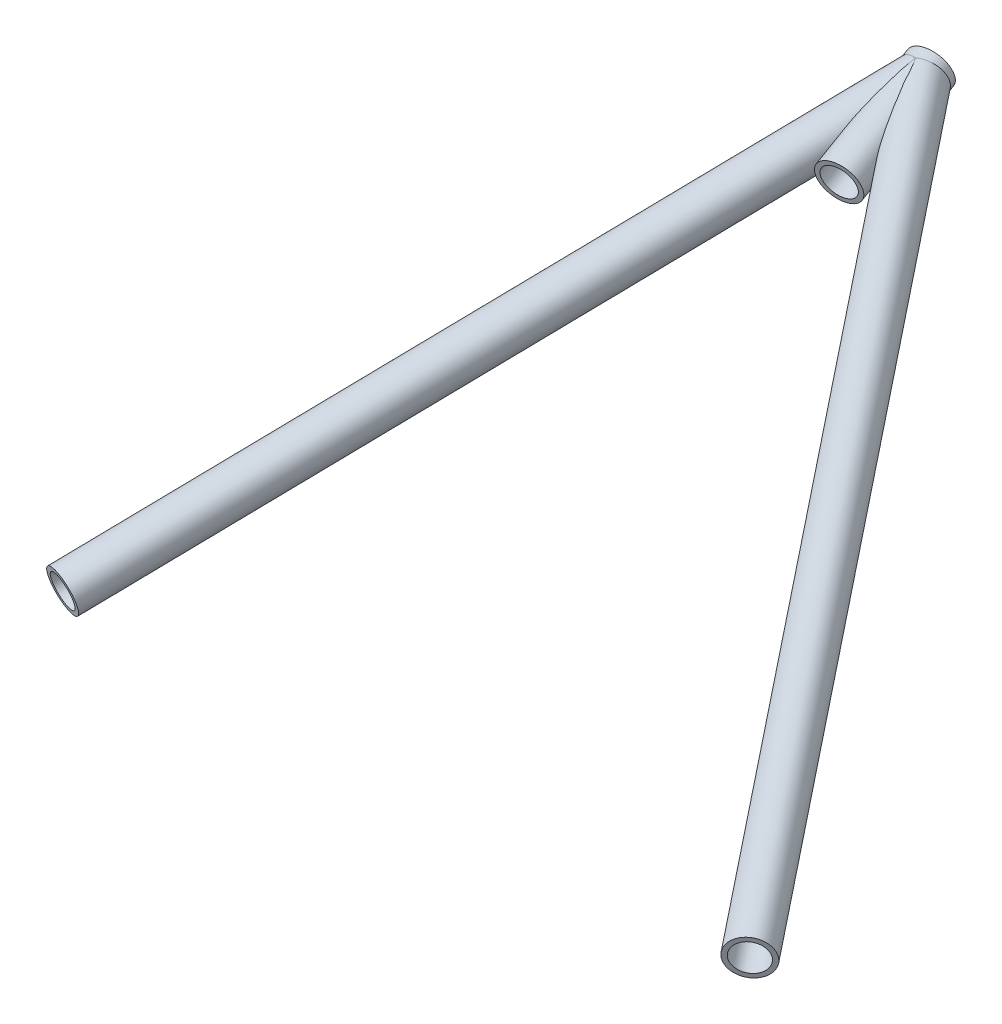
ISO-10303-21;
HEADER;
FILE_DESCRIPTION(('STEP AP214'),'2;1');
FILE_NAME('part.step','',(''),(''),'','','');
FILE_SCHEMA(('AUTOMOTIVE_DESIGN { 1 0 10303 214 1 1 1 1 }'));
ENDSEC;
DATA;
#1=APPLICATION_CONTEXT('core data for automotive mechanical design processes');
#2=APPLICATION_PROTOCOL_DEFINITION('international standard','automotive_design',2000,#1);
#3=PRODUCT_CONTEXT('',#1,'mechanical');
#4=PRODUCT('Part','Part','',(#3));
#5=PRODUCT_RELATED_PRODUCT_CATEGORY('part','',(#4));
#6=PRODUCT_DEFINITION_FORMATION('','',#4);
#7=PRODUCT_DEFINITION_CONTEXT('part definition',#1,'design');
#8=PRODUCT_DEFINITION('design','',#6,#7);
#9=PRODUCT_DEFINITION_SHAPE('','',#8);
#10=(LENGTH_UNIT() NAMED_UNIT(*) SI_UNIT(.MILLI.,.METRE.));
#11=(NAMED_UNIT(*) PLANE_ANGLE_UNIT() SI_UNIT($,.RADIAN.));
#12=(NAMED_UNIT(*) SI_UNIT($,.STERADIAN.) SOLID_ANGLE_UNIT());
#13=UNCERTAINTY_MEASURE_WITH_UNIT(LENGTH_MEASURE(1.E-05),#10,'distance_accuracy_value','');
#14=(GEOMETRIC_REPRESENTATION_CONTEXT(3) GLOBAL_UNCERTAINTY_ASSIGNED_CONTEXT((#13)) GLOBAL_UNIT_ASSIGNED_CONTEXT((#10,
#11,#12)) REPRESENTATION_CONTEXT('',''));
#15=CARTESIAN_POINT('',(0.,0.,0.));
#16=DIRECTION('',(0.,0.,1.));
#17=DIRECTION('',(1.,0.,0.));
#18=AXIS2_PLACEMENT_3D('',#15,#16,#17);
#19=CARTESIAN_POINT('',(1696.18593125395,298.313265774571,-609.984435723737));
#20=DIRECTION('',(0.586936783063146,-0.193365264339262,0.786202955498447));
#21=DIRECTION('',(0.801326519780633,0.,-0.598227221627584));
#22=AXIS2_PLACEMENT_3D('',#19,#20,#21);
#23=CYLINDRICAL_SURFACE('',#22,7.41679999999998);
#24=CARTESIAN_POINT('',(1929.45721259279,221.462462961638,-297.517103442446));
#25=DIRECTION('',(-0.586936783063146,0.193365264339262,-0.786202955498447));
#26=DIRECTION('',(-0.801326519780633,0.,0.598227221627584));
#27=AXIS2_PLACEMENT_3D('',#24,#25,#26);
#28=CIRCLE('',#27,7.41679999999998);
#29=CARTESIAN_POINT('',(1923.51393406088,221.462462961638,-293.080171785078));
#30=VERTEX_POINT('',#29);
#31=EDGE_CURVE('E109',#30,#30,#28,.T.);
#32=ORIENTED_EDGE('',*,*,#31,.F.);
#33=EDGE_LOOP('',(#32));
#34=FACE_BOUND('',#33,.T.);
#35=CARTESIAN_POINT('',(1706.02165747647,297.030905904922,-609.207426175195));
#36=CARTESIAN_POINT('',(1706.00673581778,296.841103519044,-609.227413273846));
#37=CARTESIAN_POINT('',(1705.98733985814,296.650978769853,-609.241045880463));
#38=CARTESIAN_POINT('',(1705.94016060306,296.271275535075,-609.255083840829));
#39=CARTESIAN_POINT('',(1705.9123770868,296.081697064004,-609.255488846298));
#40=CARTESIAN_POINT('',(1705.84919796562,295.704240280113,-609.242515598167));
#41=CARTESIAN_POINT('',(1705.81380072679,295.516362341264,-609.229134383668));
#42=CARTESIAN_POINT('',(1705.73641681489,295.14355209084,-609.188016254505));
#43=CARTESIAN_POINT('',(1705.69443019386,294.958619756022,-609.160279453176));
#44=CARTESIAN_POINT('',(1705.60500902473,294.592385171832,-609.089806818607));
#45=CARTESIAN_POINT('',(1705.55755916885,294.411094880365,-609.047028115088));
#46=CARTESIAN_POINT('',(1705.45885005154,294.053922003974,-608.946028945467));
#47=CARTESIAN_POINT('',(1705.40759079152,293.878039417044,-608.88780848509));
#48=CARTESIAN_POINT('',(1705.30308733114,293.53302727902,-608.755697301747));
#49=CARTESIAN_POINT('',(1705.24984467361,293.363892682493,-608.681818557565));
#50=CARTESIAN_POINT('',(1705.14330876726,293.033396564212,-608.518375530838));
#51=CARTESIAN_POINT('',(1705.09001552187,292.872034548503,-608.428812246744));
#52=CARTESIAN_POINT('',(1704.9879771568,292.565761111547,-608.23915137407));
#53=CARTESIAN_POINT('',(1704.93913696643,292.420431215509,-608.139780057658));
#54=CARTESIAN_POINT('',(1704.84496671516,292.138435012884,-607.927966292064));
#55=CARTESIAN_POINT('',(1704.79963640467,292.001768090361,-607.815524773787));
#56=CARTESIAN_POINT('',(1704.71399469042,291.737586982934,-607.578731415712));
#57=CARTESIAN_POINT('',(1704.67368147738,291.610069505586,-607.454383898296));
#58=CARTESIAN_POINT('',(1704.59921102269,291.364273460401,-607.19516722167));
#59=CARTESIAN_POINT('',(1704.56505451786,291.245995999343,-607.060296805872));
#60=CARTESIAN_POINT('',(1704.49602406218,290.990197697765,-606.746909387567));
#61=CARTESIAN_POINT('',(1704.46308950023,290.855219295926,-606.565886912209));
#62=CARTESIAN_POINT('',(1704.40863425189,290.598581230814,-606.193029772949));
#63=CARTESIAN_POINT('',(1704.38711699707,290.476925580502,-606.001191877536));
#64=CARTESIAN_POINT('',(1704.35524231705,290.245407469113,-605.609097016551));
#65=CARTESIAN_POINT('',(1704.3449108679,290.135572989478,-605.40882157173));
#66=CARTESIAN_POINT('',(1704.33474768124,289.926576611459,-605.002592836891));
#67=CARTESIAN_POINT('',(1704.33491552798,289.827414290628,-604.796639772022));
#68=CARTESIAN_POINT('',(1704.34546053741,289.624377059148,-604.350148388296));
#69=CARTESIAN_POINT('',(1704.35733891784,289.521962016027,-604.108986924925));
#70=CARTESIAN_POINT('',(1704.39194877607,289.327304572146,-603.623312143065));
#71=CARTESIAN_POINT('',(1704.41468461181,289.235066274433,-603.378797516998));
#72=CARTESIAN_POINT('',(1704.46949120538,289.059033999311,-602.887385294032));
#73=CARTESIAN_POINT('',(1704.50157641049,288.975253363104,-602.640484585225));
#74=CARTESIAN_POINT('',(1704.57367149723,288.814977347645,-602.145539495427));
#75=CARTESIAN_POINT('',(1704.61368041333,288.738481082462,-601.897495257369));
#76=CARTESIAN_POINT('',(1704.70070277427,288.591242530618,-601.399212768991));
#77=CARTESIAN_POINT('',(1704.74775842362,288.520539183174,-601.148970493799));
#78=CARTESIAN_POINT('',(1704.8476641574,288.384570506553,-600.648173056871));
#79=CARTESIAN_POINT('',(1704.90051435279,288.319305281554,-600.397617889236));
#80=CARTESIAN_POINT('',(1705.01110306714,288.193603704696,-599.896632614133));
#81=CARTESIAN_POINT('',(1705.06883717548,288.133163089674,-599.646202594999));
#82=CARTESIAN_POINT('',(1705.18852293979,288.016527603164,-599.145367932158));
#83=CARTESIAN_POINT('',(1705.25047460521,287.960332741183,-598.894963288508));
#84=CARTESIAN_POINT('',(1705.38808010555,287.843199643747,-598.354660789383));
#85=CARTESIAN_POINT('',(1705.46435165202,287.782916286716,-598.064778625151));
#86=CARTESIAN_POINT('',(1705.62098996646,287.667023501027,-597.485182064215));
#87=CARTESIAN_POINT('',(1705.70135690703,287.611414269645,-597.195467675104));
#88=CARTESIAN_POINT('',(1705.94765250895,287.451033614131,-596.326516883562));
#89=CARTESIAN_POINT('',(1706.11875695,287.352724913273,-595.74754613239));
#90=CARTESIAN_POINT('',(1706.47110520859,287.171548314561,-594.589550732133));
#91=CARTESIAN_POINT('',(1706.65236090523,287.088699019974,-594.010526846369));
#92=CARTESIAN_POINT('',(1707.02209947316,286.93802506366,-592.852894680539));
#93=CARTESIAN_POINT('',(1707.21058169521,286.870199055929,-592.274286367874));
#94=CARTESIAN_POINT('',(1707.59246434981,286.749890463263,-591.117994085909));
#95=CARTESIAN_POINT('',(1707.78585763146,286.697386820126,-590.540309943514));
#96=CARTESIAN_POINT('',(1708.17618712582,286.608601588453,-589.384831406686));
#97=CARTESIAN_POINT('',(1708.37312360939,286.572321245674,-588.807037007195));
#98=CARTESIAN_POINT('',(1708.76884935907,286.517887406104,-587.651988106915));
#99=CARTESIAN_POINT('',(1708.96763610266,286.499712088531,-587.074733795968));
#100=CARTESIAN_POINT('',(1709.36585764206,286.484402892454,-585.920230744267));
#101=CARTESIAN_POINT('',(1709.56529232166,286.487265428812,-585.342982019326));
#102=CARTESIAN_POINT('',(1709.92434349182,286.515732490038,-584.301544890679));
#103=CARTESIAN_POINT('',(1710.08412654167,286.536784393966,-583.837302363674));
#104=CARTESIAN_POINT('',(1710.32253589936,286.583910962291,-583.141336189893));
#105=CARTESIAN_POINT('',(1710.401829734,286.602222856646,-582.90931082402));
#106=CARTESIAN_POINT('',(1710.55977926024,286.64474160028,-582.445580578367));
#107=CARTESIAN_POINT('',(1710.6384349676,286.668948303468,-582.213875690787));
#108=CARTESIAN_POINT('',(1710.79460151518,286.724031429803,-581.751758482221));
#109=CARTESIAN_POINT('',(1710.87211535122,286.754884755291,-581.521344450945));
#110=CARTESIAN_POINT('',(1711.02595160608,286.824433960921,-581.061307595501));
#111=CARTESIAN_POINT('',(1711.10227412188,286.86312919911,-580.831684708133));
#112=CARTESIAN_POINT('',(1711.25320225255,286.949809507487,-580.373947594193));
#113=CARTESIAN_POINT('',(1711.32780993863,286.997782631775,-580.145831813581));
#114=CARTESIAN_POINT('',(1711.47476981037,287.105072688683,-579.691583083834));
#115=CARTESIAN_POINT('',(1711.54712283632,287.164385334939,-579.465449419127));
#116=CARTESIAN_POINT('',(1711.66234858359,287.272609602529,-579.099760179352));
#117=CARTESIAN_POINT('',(1711.70619201726,287.317205412571,-578.959235356503));
#118=CARTESIAN_POINT('',(1711.79226987723,287.413056832389,-578.67990618022));
#119=CARTESIAN_POINT('',(1711.83450387985,287.464314180375,-578.541102286222));
#120=CARTESIAN_POINT('',(1711.91678843494,287.574642384202,-578.266247417052));
#121=CARTESIAN_POINT('',(1711.95684273,287.633699209502,-578.130191992748));
#122=CARTESIAN_POINT('',(1712.0341229033,287.76129777923,-577.86182145355));
#123=CARTESIAN_POINT('',(1712.07135048488,287.829833740236,-577.729504116803));
#124=CARTESIAN_POINT('',(1712.14415679505,287.983104737118,-577.462361580691));
#125=CARTESIAN_POINT('',(1712.17949155459,288.068578983069,-577.327886500858));
#126=CARTESIAN_POINT('',(1712.24394632056,288.255738715878,-577.068864806687));
#127=CARTESIAN_POINT('',(1712.27307051578,288.357413194898,-576.944311536202));
#128=CARTESIAN_POINT('',(1712.31676178159,288.555357291404,-576.737394655839));
#129=CARTESIAN_POINT('',(1712.33312563671,288.647804562354,-576.651807160795));
#130=CARTESIAN_POINT('',(1712.35855524456,288.845109744886,-576.495046582663));
#131=CARTESIAN_POINT('',(1712.36763565059,288.949942248802,-576.423844774669));
#132=CARTESIAN_POINT('',(1712.37606554908,289.152573284875,-576.31106599501));
#133=CARTESIAN_POINT('',(1712.37677858194,289.24865718231,-576.266534741664));
#134=CARTESIAN_POINT('',(1712.37142939253,289.446525748462,-576.193388794709));
#135=CARTESIAN_POINT('',(1712.365370577,289.548307526266,-576.164766108757));
#136=CARTESIAN_POINT('',(1712.34670248247,289.754335666234,-576.1242603837));
#137=CARTESIAN_POINT('',(1712.33410436199,289.858577542222,-576.11234895669));
#138=CARTESIAN_POINT('',(1712.30323170095,290.066821202277,-576.104097505337));
#139=CARTESIAN_POINT('',(1712.2849515195,290.17082264383,-576.107773000996));
#140=CARTESIAN_POINT('',(1712.23374349447,290.427091717086,-576.13364890604));
#141=CARTESIAN_POINT('',(1712.19803322785,290.577943414102,-576.164070528728));
#142=CARTESIAN_POINT('',(1712.11990691476,290.871661501556,-576.2468419912));
#143=CARTESIAN_POINT('',(1712.07747193579,291.014503757398,-576.299254451012));
#144=CARTESIAN_POINT('',(1711.99101913826,291.283312743292,-576.416036696457));
#145=CARTESIAN_POINT('',(1711.94725734547,291.40977722868,-576.479477794236));
#146=CARTESIAN_POINT('',(1711.85710419034,291.656081683409,-576.616653503584));
#147=CARTESIAN_POINT('',(1711.81071033497,291.775915152449,-576.690397974325));
#148=CARTESIAN_POINT('',(1711.71600798229,292.00991252984,-576.845839760501));
#149=CARTESIAN_POINT('',(1711.6676951672,292.124062178366,-576.927555692528));
#150=CARTESIAN_POINT('',(1711.56980114917,292.347085047603,-577.097028804988));
#151=CARTESIAN_POINT('',(1711.52022050266,292.45596052433,-577.184783362827));
#152=CARTESIAN_POINT('',(1711.38715304752,292.739401042865,-577.424522917533));
#153=CARTESIAN_POINT('',(1711.30284509883,292.909995013015,-577.580740213895));
#154=CARTESIAN_POINT('',(1711.13265204176,293.241122300947,-577.902754895929));
#155=CARTESIAN_POINT('',(1711.04676604302,293.401649698626,-578.068557810729));
#156=CARTESIAN_POINT('',(1710.87387441638,293.714609589258,-578.407710368127));
#157=CARTESIAN_POINT('',(1710.78686695639,293.867025959006,-578.581073880676));
#158=CARTESIAN_POINT('',(1710.61227074065,294.164767523639,-578.933511090491));
#159=CARTESIAN_POINT('',(1710.52468191809,294.31009188673,-579.112585453506));
#160=CARTESIAN_POINT('',(1710.34873284269,294.595385174957,-579.476300230731));
#161=CARTESIAN_POINT('',(1710.2603709514,294.735322101025,-579.660964865286));
#162=CARTESIAN_POINT('',(1710.0835185762,295.009834312928,-580.034179027311));
#163=CARTESIAN_POINT('',(1709.995028087,295.144409371163,-580.222728719179));
#164=CARTESIAN_POINT('',(1709.81817770761,295.408656306455,-580.602883213475));
#165=CARTESIAN_POINT('',(1709.72981779317,295.538334138427,-580.794483874426));
#166=CARTESIAN_POINT('',(1709.5532326434,295.793468518336,-581.180529418666));
#167=CARTESIAN_POINT('',(1709.46500740763,295.918925080448,-581.374974292404));
#168=CARTESIAN_POINT('',(1709.26753189215,296.195839263943,-581.813575179307));
#169=CARTESIAN_POINT('',(1709.15834361105,296.346268764314,-582.058408147956));
#170=CARTESIAN_POINT('',(1708.94047925172,296.641904198261,-582.551437404445));
#171=CARTESIAN_POINT('',(1708.83180319474,296.787109916689,-582.799633830235));
#172=CARTESIAN_POINT('',(1708.50672987952,297.215720168797,-583.548754145803));
#173=CARTESIAN_POINT('',(1708.29131526716,297.492079215525,-584.05414730699));
#174=CARTESIAN_POINT('',(1707.86394908448,298.029358806916,-585.075455900364));
#175=CARTESIAN_POINT('',(1707.65200262478,298.290257834289,-585.591384713585));
#176=CARTESIAN_POINT('',(1707.23308990091,298.798174372415,-586.631950672212));
#177=CARTESIAN_POINT('',(1707.02612319946,299.045193104549,-587.156587046127));
#178=CARTESIAN_POINT('',(1706.61935295359,299.525794468289,-588.212153464212));
#179=CARTESIAN_POINT('',(1706.41952630141,299.759422274003,-588.743054047122));
#180=CARTESIAN_POINT('',(1706.0281330771,300.214901758383,-589.812954910295));
#181=CARTESIAN_POINT('',(1705.83656722131,300.436752416183,-590.351955887538));
#182=CARTESIAN_POINT('',(1705.46447674254,300.86852222511,-591.43777069037));
#183=CARTESIAN_POINT('',(1705.28394023396,301.07845420233,-591.98457529332));
#184=CARTESIAN_POINT('',(1705.02404590805,301.38402632937,-592.811594497165));
#185=CARTESIAN_POINT('',(1704.93923824896,301.48432291872,-593.088383963408));
#186=CARTESIAN_POINT('',(1704.77388372001,301.681605867048,-593.644400902294));
#187=CARTESIAN_POINT('',(1704.69333675348,301.778592301101,-593.923628319463));
#188=CARTESIAN_POINT('',(1704.51192637859,301.999837866402,-594.575656713254));
#189=CARTESIAN_POINT('',(1704.41294215486,302.122745169429,-594.949446314826));
#190=CARTESIAN_POINT('',(1704.22590400146,302.361235219671,-595.70216356258));
#191=CARTESIAN_POINT('',(1704.13785201856,302.476816660527,-596.081092110605));
#192=CARTESIAN_POINT('',(1703.97560387456,302.698979875966,-596.844663910848));
#193=CARTESIAN_POINT('',(1703.90140957647,302.805560439425,-597.229307923957));
#194=CARTESIAN_POINT('',(1703.80350158889,302.956577499446,-597.810778757054));
#195=CARTESIAN_POINT('',(1703.77309814692,303.0054371836,-598.005336760058));
#196=CARTESIAN_POINT('',(1703.71736693563,303.099709635623,-598.396002873596));
#197=CARTESIAN_POINT('',(1703.69203886101,303.145122610715,-598.592110890157));
#198=CARTESIAN_POINT('',(1703.63920424214,303.247239092256,-599.055441149856));
#199=CARTESIAN_POINT('',(1703.61408758233,303.302265615709,-599.323317975052));
#200=CARTESIAN_POINT('',(1703.57632486432,303.402974452684,-599.861780445373));
#201=CARTESIAN_POINT('',(1703.56368020701,303.448655716066,-600.132366391346));
#202=CARTESIAN_POINT('',(1703.55302492076,303.527957835842,-600.675088985327));
#203=CARTESIAN_POINT('',(1703.55498424677,303.561603304246,-600.947221299288));
#204=CARTESIAN_POINT('',(1703.57560953296,303.613579630977,-601.492329313605));
#205=CARTESIAN_POINT('',(1703.59426754657,303.631917765739,-601.765304551261));
#206=CARTESIAN_POINT('',(1703.64166067538,303.646649213793,-602.229214343993));
#207=CARTESIAN_POINT('',(1703.66576557641,303.647938111784,-602.420468216501));
#208=CARTESIAN_POINT('',(1703.7232837008,303.639386832468,-602.801301179637));
#209=CARTESIAN_POINT('',(1703.75669390253,303.629550264671,-602.990880793351));
#210=CARTESIAN_POINT('',(1703.83263666698,303.597264495231,-603.36696882085));
#211=CARTESIAN_POINT('',(1703.87516104348,303.574826582806,-603.553479829994));
#212=CARTESIAN_POINT('',(1703.96867035452,303.516035149325,-603.922161590667));
#213=CARTESIAN_POINT('',(1704.01965520963,303.479681758911,-604.104332382926));
#214=CARTESIAN_POINT('',(1704.12921348921,303.391810975629,-604.464020979565));
#215=CARTESIAN_POINT('',(1704.18783416722,303.340196378838,-604.641500759702));
#216=CARTESIAN_POINT('',(1704.31066257574,303.221380345888,-604.989171276509));
#217=CARTESIAN_POINT('',(1704.37487047642,303.154178434865,-605.159361790927));
#218=CARTESIAN_POINT('',(1704.50685022478,303.004123904674,-605.491409264894));
#219=CARTESIAN_POINT('',(1704.57462459378,302.921260103077,-605.653260164318));
#220=CARTESIAN_POINT('',(1704.71149643146,302.740345560522,-605.967632819523));
#221=CARTESIAN_POINT('',(1704.7805938602,302.642295277433,-606.120154856373));
#222=CARTESIAN_POINT('',(1704.91207926615,302.440813402789,-606.402634675259));
#223=CARTESIAN_POINT('',(1704.97453495645,302.338562260688,-606.533406155521));
#224=CARTESIAN_POINT('',(1705.09725023908,302.122786528703,-606.786375396151));
#225=CARTESIAN_POINT('',(1705.15750999158,302.009262763299,-606.908573782442));
#226=CARTESIAN_POINT('',(1705.27449711503,301.771795643232,-607.144226055896));
#227=CARTESIAN_POINT('',(1705.33122431584,301.647851787407,-607.257679521963));
#228=CARTESIAN_POINT('',(1705.43998907526,301.390465951181,-607.475716984243));
#229=CARTESIAN_POINT('',(1705.49202637474,301.257023446708,-607.580300490372));
#230=CARTESIAN_POINT('',(1705.59352103876,300.972956739631,-607.786768650459));
#231=CARTESIAN_POINT('',(1705.64261233877,300.821779859197,-607.888073409145));
#232=CARTESIAN_POINT('',(1705.73344819626,300.510927862242,-608.08042097972));
#233=CARTESIAN_POINT('',(1705.77519243856,300.351252381524,-608.171463351307));
#234=CARTESIAN_POINT('',(1705.85059754308,300.024558911171,-608.343132168399));
#235=CARTESIAN_POINT('',(1705.88425818011,299.857540717134,-608.423758323696));
#236=CARTESIAN_POINT('',(1705.94295375268,299.517322246039,-608.57439571225));
#237=CARTESIAN_POINT('',(1705.96798890052,299.344122121244,-608.644407206726));
#238=CARTESIAN_POINT('',(1706.00856653463,298.997084885626,-608.771957469955));
#239=CARTESIAN_POINT('',(1706.02433090875,298.823372195914,-608.829764537273));
#240=CARTESIAN_POINT('',(1706.04716569101,298.472146667269,-608.934808525344));
#241=CARTESIAN_POINT('',(1706.05423280684,298.294632415119,-608.98204143775));
#242=CARTESIAN_POINT('',(1706.05965577032,297.936913822987,-609.065589878692));
#243=CARTESIAN_POINT('',(1706.05801127669,297.756709377892,-609.101904979462));
#244=CARTESIAN_POINT('',(1706.04616714856,297.394737048595,-609.163234889436));
#245=CARTESIAN_POINT('',(1706.03597075834,297.212969783147,-609.188253978397));
#246=CARTESIAN_POINT('',(1706.02165747647,297.030905904922,-609.207426175195));
#247=B_SPLINE_CURVE_WITH_KNOTS('',3,(#35,#36,#37,#38,#39,#40,#41,#42,#43,#44,#45,#46,#47,#48,
#49,#50,#51,#52,#53,#54,#55,#56,#57,#58,#59,#60,#61,#62,#63,#64,#65,#66,#67,#68,#69,#70,#71,#72,
#73,#74,#75,#76,#77,#78,#79,#80,#81,#82,#83,#84,#85,#86,#87,#88,#89,#90,#91,#92,#93,#94,#95,#96,
#97,#98,#99,#100,#101,#102,#103,#104,#105,#106,#107,#108,#109,#110,#111,#112,#113,#114,#115,
#116,#117,#118,#119,#120,#121,#122,#123,#124,#125,#126,#127,#128,#129,#130,#131,#132,#133,#134,
#135,#136,#137,#138,#139,#140,#141,#142,#143,#144,#145,#146,#147,#148,#149,#150,#151,#152,#153,
#154,#155,#156,#157,#158,#159,#160,#161,#162,#163,#164,#165,#166,#167,#168,#169,#170,#171,#172,
#173,#174,#175,#176,#177,#178,#179,#180,#181,#182,#183,#184,#185,#186,#187,#188,#189,#190,#191,
#192,#193,#194,#195,#196,#197,#198,#199,#200,#201,#202,#203,#204,#205,#206,#207,#208,#209,#210,
#211,#212,#213,#214,#215,#216,#217,#218,#219,#220,#221,#222,#223,#224,#225,#226,#227,#228,#229,
#230,#231,#232,#233,#234,#235,#236,#237,#238,#239,#240,#241,#242,#243,#244,#245,#246),
.UNSPECIFIED.,.T.,.F.,(4,2,2,2,2,2,2,2,2,2,2,2,2,2,2,2,2,2,2,2,2,2,2,2,2,2,2,2,2,2,2,2,2,2,2,2,
2,2,2,2,2,2,2,2,2,2,2,2,2,2,2,2,2,2,2,2,2,2,2,2,2,2,2,2,2,2,2,2,2,2,2,2,2,2,2,2,2,2,2,2,2,2,2,2,
2,2,2,2,2,2,2,2,2,2,2,2,2,2,2,2,2,2,2,2,2,4),(0.,0.574151275382462,1.14831766800678,
1.72260740137623,2.296892600893,2.87282799279553,3.44876317115333,4.02425933197849,
4.59971887104737,5.14712857839256,5.69449932114901,6.24167209321343,6.78891030602429,
7.47242075871127,8.15613652935075,8.84143666399751,9.52670966171098,10.3129926627842,
11.0995915267926,11.8874124032728,12.6751373416048,13.4677842361595,14.2604463120172,
15.0524000320317,15.8443555253407,16.7615301813815,17.6787435284927,19.5134019947082,
21.3502541791536,23.1869417250939,25.0210930128394,26.8553851173875,28.6874637870278,
30.5192302527021,31.9931047554359,32.7306971522825,33.4682712713172,34.2033224460803,
34.9383134725017,35.6723643744238,36.4061383500634,36.8674478385666,37.3288779401915,
37.7894889992185,38.2498202593181,38.7385918041611,39.2270326407056,39.6069008107843,
39.9860028075153,40.3022625540152,40.6183632700834,40.9339263637531,41.2498037394128,
41.7210220392224,42.1935913627706,42.6372242234307,43.0812845358824,43.5264079361407,
43.9713392233644,44.70935405677,45.4477989196802,46.1876606828538,46.927609013856,
47.6714288978679,48.4152803217858,49.1581960318027,49.9011092472057,50.8232310969298,
51.745390881927,53.5899441500655,55.4370071241908,57.2839073127778,59.1241577876502,
60.9645675194093,62.8029576451338,63.7220281708869,64.6410778379327,65.8580786438684,
67.0752958603398,68.2926766009728,68.9012654897403,69.5098177602161,70.3332966156811,
71.1568679558482,71.9787454149558,72.8002319667779,73.3780667227969,73.9557140616899,
74.5328447249371,75.1099699700809,75.6908533584024,76.2717544454759,76.8530718675366,
77.4343717664691,77.9658767475643,78.4973428829746,79.0288345942676,79.5603556525165,
80.12518725201,80.6900430761221,81.2549146343663,81.8197722892924,82.3704935408063,
82.9214232021492,83.4723744464766,84.0231167746117),.UNSPECIFIED.);
#248=CARTESIAN_POINT('',(1706.02165747647,297.030905904922,-609.207426175195));
#249=VERTEX_POINT('',#248);
#250=EDGE_CURVE('E83',#249,#249,#247,.T.);
#251=ORIENTED_EDGE('',*,*,#250,.T.);
#252=EDGE_LOOP('',(#251));
#253=FACE_BOUND('',#252,.T.);
#254=ADVANCED_FACE('F65',(#34,#253),#23,.F.);
#255=CARTESIAN_POINT('',(1695.27005223557,299.62724687487,-614.720955468418));
#256=DIRECTION('',(0.18317580367567,-0.262796220059855,0.94730394893615));
#257=DIRECTION('',(0.,-0.963608030897897,-0.267319215151245));
#258=AXIS2_PLACEMENT_3D('',#255,#256,#257);
#259=CYLINDRICAL_SURFACE('',#258,9.52499999999994);
#260=ORIENTED_EDGE('',*,*,#250,.F.);
#261=EDGE_LOOP('',(#260));
#262=FACE_BOUND('',#261,.T.);
#263=CARTESIAN_POINT('',(1696.18593125395,298.313265774571,-609.984435723738));
#264=DIRECTION('',(0.394737380314413,-0.233815149177805,0.88854537115303));
#265=DIRECTION('',(0.917171793543887,0.157717356150483,-0.365952369436776));
#266=AXIS2_PLACEMENT_3D('',#263,#264,#265);
#267=ELLIPSE('',#266,9.76447759000189,9.52499999999998);
#268=CARTESIAN_POINT('',(1695.66611562887,307.451587268054,-607.348814924447));
#269=VERTEX_POINT('',#268);
#270=CARTESIAN_POINT('',(1696.70574687903,289.174944281087,-612.620056523029));
#271=VERTEX_POINT('',#270);
#272=EDGE_CURVE('E74',#269,#271,#267,.F.);
#273=ORIENTED_EDGE('',*,*,#272,.T.);
#274=CARTESIAN_POINT('',(1696.18593125395,298.313265774571,-609.984435723738));
#275=DIRECTION('',(0.917171793543887,0.157717356150483,-0.365952369436776));
#276=DIRECTION('',(0.394737380314413,-0.233815149177805,0.88854537115303));
#277=AXIS2_PLACEMENT_3D('',#274,#275,#276);
#278=ELLIPSE('',#277,43.2734304674934,9.52499999999998);
#279=EDGE_CURVE('E13',#271,#269,#278,.F.);
#280=ORIENTED_EDGE('',*,*,#279,.T.);
#281=EDGE_LOOP('',(#273,#280));
#282=FACE_BOUND('',#281,.T.);
#283=ADVANCED_FACE('F81',(#262,#282),#259,.F.);
#284=CARTESIAN_POINT('',(1696.18593125395,298.313265774571,-609.984435723737));
#285=DIRECTION('',(0.586936783063146,-0.193365264339262,0.786202955498447));
#286=DIRECTION('',(0.801326519780633,0.,-0.598227221627584));
#287=AXIS2_PLACEMENT_3D('',#284,#285,#286);
#288=CYLINDRICAL_SURFACE('',#287,9.52500000000001);
#289=CARTESIAN_POINT('',(1929.45721259279,221.462462961638,-297.517103442446));
#290=DIRECTION('',(-0.586936783063146,0.193365264339262,-0.786202955498447));
#291=DIRECTION('',(-0.801326519780633,0.,0.598227221627584));
#292=AXIS2_PLACEMENT_3D('',#289,#290,#291);
#293=CIRCLE('',#292,9.52500000000001);
#294=CARTESIAN_POINT('',(1921.82457749188,221.462462961638,-291.818989156443));
#295=VERTEX_POINT('',#294);
#296=EDGE_CURVE('E69',#295,#295,#293,.T.);
#297=ORIENTED_EDGE('',*,*,#296,.T.);
#298=EDGE_LOOP('',(#297));
#299=FACE_BOUND('',#298,.T.);
#300=ORIENTED_EDGE('',*,*,#272,.F.);
#301=ORIENTED_EDGE('',*,*,#279,.F.);
#302=EDGE_LOOP('',(#300,#301));
#303=FACE_BOUND('',#302,.T.);
#304=ADVANCED_FACE('F67',(#299,#303),#288,.T.);
#305=CARTESIAN_POINT('',(1929.45721259279,221.462462961638,-297.517103442446));
#306=DIRECTION('',(-0.586936783063146,0.193365264339262,-0.786202955498447));
#307=DIRECTION('',(-0.801326519780633,0.,0.598227221627584));
#308=AXIS2_PLACEMENT_3D('',#305,#306,#307);
#309=PLANE('',#308);
#310=ORIENTED_EDGE('',*,*,#31,.T.);
#311=EDGE_LOOP('',(#310));
#312=FACE_BOUND('',#311,.T.);
#313=ORIENTED_EDGE('',*,*,#296,.F.);
#314=EDGE_LOOP('',(#313));
#315=FACE_BOUND('',#314,.T.);
#316=ADVANCED_FACE('F86',(#312,#315),#309,.F.);
#317=CLOSED_SHELL('',(#254,#283,#304,#316));
#318=MANIFOLD_SOLID_BREP('B2',#317);
#319=CARTESIAN_POINT('',(1600.,194.785610189008,-270.));
#320=DIRECTION('',(0.261244511464905,0.281184903592084,-0.923410177126814));
#321=DIRECTION('',(0.,0.956631443980582,0.291301013365261));
#322=AXIS2_PLACEMENT_3D('',#319,#320,#321);
#323=CYLINDRICAL_SURFACE('',#322,7.41679999999998);
#324=CARTESIAN_POINT('',(1609.14355790127,204.627081814731,-302.319356199439));
#325=DIRECTION('',(0.261244511464905,0.281184903592084,-0.923410177126814));
#326=DIRECTION('',(0.,0.956631443980581,0.291301013365261));
#327=AXIS2_PLACEMENT_3D('',#324,#325,#326);
#328=CIRCLE('',#327,7.41679999999998);
#329=CARTESIAN_POINT('',(1609.14355790127,211.722225908446,-300.158834843511));
#330=VERTEX_POINT('',#329);
#331=EDGE_CURVE('E184',#330,#330,#328,.T.);
#332=ORIENTED_EDGE('',*,*,#331,.F.);
#333=EDGE_LOOP('',(#332));
#334=FACE_BOUND('',#333,.T.);
#335=CARTESIAN_POINT('',(1692.35451797443,301.284550700558,-594.281176205588));
#336=CARTESIAN_POINT('',(1692.40321256167,301.19489699609,-593.986749530908));
#337=CARTESIAN_POINT('',(1692.44833392335,301.101948032664,-593.692735606924));
#338=CARTESIAN_POINT('',(1692.53255673058,300.910417652576,-593.105669620011));
#339=CARTESIAN_POINT('',(1692.57165764861,300.811835743391,-592.812617643568));
#340=CARTESIAN_POINT('',(1692.64477115754,300.609698549196,-592.22748831856));
#341=CARTESIAN_POINT('',(1692.67878200232,300.506141573557,-591.935411337899));
#342=CARTESIAN_POINT('',(1692.74245671099,300.294575305461,-591.352393895294));
#343=CARTESIAN_POINT('',(1692.77212040604,300.186565840279,-591.061453477921));
#344=CARTESIAN_POINT('',(1692.85565928255,299.856040353689,-590.189426959023));
#345=CARTESIAN_POINT('',(1692.90396271021,299.627373076613,-589.610129258401));
#346=CARTESIAN_POINT('',(1692.98960354427,299.155359138829,-588.456898481575));
#347=CARTESIAN_POINT('',(1693.02694290721,298.912015106544,-587.882964465941));
#348=CARTESIAN_POINT('',(1693.09368746726,298.408752980053,-586.735632212745));
#349=CARTESIAN_POINT('',(1693.12301659658,298.148703123124,-586.162287370279));
#350=CARTESIAN_POINT('',(1693.17534822545,297.613681295601,-585.022246750042));
#351=CARTESIAN_POINT('',(1693.19835018428,297.338708052062,-584.455551544506));
#352=CARTESIAN_POINT('',(1693.23955544476,296.773219693495,-583.331082260448));
#353=CARTESIAN_POINT('',(1693.25776744769,296.482733929654,-582.773293758744));
#354=CARTESIAN_POINT('',(1693.29069950934,295.883773828645,-581.667390754462));
#355=CARTESIAN_POINT('',(1693.30542006517,295.575302060125,-581.119274884992));
#356=CARTESIAN_POINT('',(1693.3256781672,295.097021289804,-580.307149116838));
#357=CARTESIAN_POINT('',(1693.33212023512,294.935208505741,-580.038441270598));
#358=CARTESIAN_POINT('',(1693.34453395958,294.605688475307,-579.504654778778));
#359=CARTESIAN_POINT('',(1693.35050563145,294.437981421193,-579.239576015215));
#360=CARTESIAN_POINT('',(1693.36212452755,294.095544985388,-578.713089268));
#361=CARTESIAN_POINT('',(1693.36777095678,293.920800035183,-578.45169136843));
#362=CARTESIAN_POINT('',(1693.37886544024,293.563725131696,-577.934144729642));
#363=CARTESIAN_POINT('',(1693.38431351374,293.381395919245,-577.677995481366));
#364=CARTESIAN_POINT('',(1693.39512999131,293.009325898411,-577.17414862671));
#365=CARTESIAN_POINT('',(1693.40049868579,292.819653054926,-576.926401092177));
#366=CARTESIAN_POINT('',(1693.41138578613,292.429988104305,-576.439202455458));
#367=CARTESIAN_POINT('',(1693.41690416353,292.22999795278,-576.199749795285));
#368=CARTESIAN_POINT('',(1693.42831297223,291.818084776206,-575.73264719619));
#369=CARTESIAN_POINT('',(1693.43420205473,291.606205284953,-575.504959399402));
#370=CARTESIAN_POINT('',(1693.44357642706,291.276706065847,-575.175303674284));
#371=CARTESIAN_POINT('',(1693.44678992795,291.164974072197,-575.067439158021));
#372=CARTESIAN_POINT('',(1693.45345578117,290.937053185211,-574.856548811978));
#373=CARTESIAN_POINT('',(1693.45690808842,290.820865134657,-574.753522075338));
#374=CARTESIAN_POINT('',(1693.46416850838,290.58185817668,-574.55219176005));
#375=CARTESIAN_POINT('',(1693.46798065028,290.458972878213,-574.453966637352));
#376=CARTESIAN_POINT('',(1693.47601856145,290.207108078141,-574.265380550495));
#377=CARTESIAN_POINT('',(1693.48024466084,290.078123755754,-574.175025973264));
#378=CARTESIAN_POINT('',(1693.48919503974,289.814266466425,-574.005447157257));
#379=CARTESIAN_POINT('',(1693.49391556695,289.679441841019,-573.926148409514));
#380=CARTESIAN_POINT('',(1693.50401909068,289.402516013704,-573.781747967443));
#381=CARTESIAN_POINT('',(1693.50940093023,289.260427766872,-573.716622015935));
#382=CARTESIAN_POINT('',(1693.5198223221,288.998281083395,-573.617144449172));
#383=CARTESIAN_POINT('',(1693.52471022339,288.879593435595,-573.579230944988));
#384=CARTESIAN_POINT('',(1693.53509416451,288.638036944649,-573.519566295602));
#385=CARTESIAN_POINT('',(1693.54059039493,288.515166799481,-573.497820232384));
#386=CARTESIAN_POINT('',(1693.55228427072,288.265802772052,-573.474637949174));
#387=CARTESIAN_POINT('',(1693.55848975368,288.139282863191,-573.473456367367));
#388=CARTESIAN_POINT('',(1693.5714344696,287.888500239805,-573.495655116016));
#389=CARTESIAN_POINT('',(1693.57817262495,287.764233563228,-573.51898697485));
#390=CARTESIAN_POINT('',(1693.59117149443,287.536579444934,-573.586511623852));
#391=CARTESIAN_POINT('',(1693.59740188151,287.432407495432,-573.628093664458));
#392=CARTESIAN_POINT('',(1693.60988857766,287.232772113681,-573.728591283975));
#393=CARTESIAN_POINT('',(1693.61614490788,287.137318519956,-573.787526136193));
#394=CARTESIAN_POINT('',(1693.63044960658,286.928222146603,-573.939776842204));
#395=CARTESIAN_POINT('',(1693.63844560271,286.818244568201,-574.038079741028));
#396=CARTESIAN_POINT('',(1693.65399954518,286.615042392466,-574.250678782107));
#397=CARTESIAN_POINT('',(1693.66155641545,286.521857862588,-574.365012047077));
#398=CARTESIAN_POINT('',(1693.67537600759,286.359400448225,-574.590896724713));
#399=CARTESIAN_POINT('',(1693.68168997114,286.288627941542,-574.701390629913));
#400=CARTESIAN_POINT('',(1693.69394206882,286.156756791295,-574.928085334802));
#401=CARTESIAN_POINT('',(1693.69987987327,286.09566656528,-575.044290986426));
#402=CARTESIAN_POINT('',(1693.71141104023,285.981540616268,-575.28087500405));
#403=CARTESIAN_POINT('',(1693.71700361954,285.92852283449,-575.401261954864));
#404=CARTESIAN_POINT('',(1693.72785534109,285.829436725207,-575.644794110324));
#405=CARTESIAN_POINT('',(1693.73311460525,285.783365848355,-575.767938283989));
#406=CARTESIAN_POINT('',(1693.74617413707,285.673057838698,-576.085461377677));
#407=CARTESIAN_POINT('',(1693.75375733294,285.61300283284,-576.281298197425));
#408=CARTESIAN_POINT('',(1693.76826521507,285.504163442238,-576.676141269604));
#409=CARTESIAN_POINT('',(1693.77518953886,285.455385240413,-576.875149197098));
#410=CARTESIAN_POINT('',(1693.78844696752,285.366959840808,-577.275566841505));
#411=CARTESIAN_POINT('',(1693.79477895271,285.327329736044,-577.476980326651));
#412=CARTESIAN_POINT('',(1693.80688066342,285.255759496191,-577.881190386604));
#413=CARTESIAN_POINT('',(1693.8126503225,285.223820269084,-578.083987121813));
#414=CARTESIAN_POINT('',(1693.82369444851,285.16627341328,-578.491890488786));
#415=CARTESIAN_POINT('',(1693.82896527221,285.140710424113,-578.697003443334));
#416=CARTESIAN_POINT('',(1693.83898805354,285.095282088341,-579.10787188742));
#417=CARTESIAN_POINT('',(1693.84373999131,285.07541695973,-579.313627401238));
#418=CARTESIAN_POINT('',(1693.85273180833,285.040688191507,-579.725285314199));
#419=CARTESIAN_POINT('',(1693.85697237327,285.025817805626,-579.931187135726));
#420=CARTESIAN_POINT('',(1693.86495533487,285.000471681933,-580.343263120554));
#421=CARTESIAN_POINT('',(1693.8686977371,284.989995894901,-580.549437280778));
#422=CARTESIAN_POINT('',(1693.87866393111,284.965705240132,-581.137689361145));
#423=CARTESIAN_POINT('',(1693.88428531061,284.956649635834,-581.519977725723));
#424=CARTESIAN_POINT('',(1693.89379761111,284.949709310978,-582.28469497114));
#425=CARTESIAN_POINT('',(1693.89768831875,284.951825967397,-582.66712386349));
#426=CARTESIAN_POINT('',(1693.90366406187,284.965626299072,-583.431983203004));
#427=CARTESIAN_POINT('',(1693.90574830218,284.977314183076,-583.814413576824));
#428=CARTESIAN_POINT('',(1693.90799219322,285.00905572662,-584.578934709556));
#429=CARTESIAN_POINT('',(1693.90815179249,285.029109609845,-584.961025459112));
#430=CARTESIAN_POINT('',(1693.90638626664,285.076746749097,-585.725959442119));
#431=CARTESIAN_POINT('',(1693.90445444685,285.104353971521,-586.108801153079));
#432=CARTESIAN_POINT('',(1693.89829185962,285.166363980358,-586.873915855092));
#433=CARTESIAN_POINT('',(1693.89406106963,285.20076683339,-587.256188840532));
#434=CARTESIAN_POINT('',(1693.88304718764,285.275817703607,-588.019963957977));
#435=CARTESIAN_POINT('',(1693.87626488029,285.316463798582,-588.401466290751));
#436=CARTESIAN_POINT('',(1693.85983232755,285.403605243922,-589.163740657201));
#437=CARTESIAN_POINT('',(1693.85018207473,285.45010060947,-589.544512688979));
#438=CARTESIAN_POINT('',(1693.82769655192,285.548336377991,-590.302800920252));
#439=CARTESIAN_POINT('',(1693.81488210082,285.600041238537,-590.680322341277));
#440=CARTESIAN_POINT('',(1693.7855663154,285.708760792822,-591.434448145999));
#441=CARTESIAN_POINT('',(1693.76906507139,285.765775356462,-591.811052551932));
#442=CARTESIAN_POINT('',(1693.73178398822,285.885063970493,-592.563374785838));
#443=CARTESIAN_POINT('',(1693.71100241428,285.947340147301,-592.939092191675));
#444=CARTESIAN_POINT('',(1693.66443650012,286.077167343225,-593.689302857438));
#445=CARTESIAN_POINT('',(1693.63865222713,286.144718291433,-594.063796133748));
#446=CARTESIAN_POINT('',(1693.58125944281,286.28503497248,-594.810096943858));
#447=CARTESIAN_POINT('',(1693.54967011707,286.357783058421,-595.18190925008));
#448=CARTESIAN_POINT('',(1693.47946490604,286.509020332555,-595.923734903454));
#449=CARTESIAN_POINT('',(1693.44084858823,286.587509873963,-596.29374813843));
#450=CARTESIAN_POINT('',(1693.35516094217,286.750715341162,-597.031161228562));
#451=CARTESIAN_POINT('',(1693.3080953523,286.835427018208,-597.398562682556));
#452=CARTESIAN_POINT('',(1693.20363887942,287.011949266035,-598.13015502765));
#453=CARTESIAN_POINT('',(1693.14624990553,287.103758522458,-598.494346499337));
#454=CARTESIAN_POINT('',(1693.05888607097,287.235314917707,-598.990367142739));
#455=CARTESIAN_POINT('',(1693.03439908011,287.271448908168,-599.124132427424));
#456=CARTESIAN_POINT('',(1692.98352905863,287.34495840164,-599.390960619915));
#457=CARTESIAN_POINT('',(1692.9571460113,287.382333915596,-599.524023521518));
#458=CARTESIAN_POINT('',(1692.87491632802,287.496474415346,-599.922051803074));
#459=CARTESIAN_POINT('',(1692.81599484091,287.57524472443,-600.185823985619));
#460=CARTESIAN_POINT('',(1692.68844422931,287.739229559889,-600.709543616366));
#461=CARTESIAN_POINT('',(1692.61979832521,287.824455104027,-600.969483577627));
#462=CARTESIAN_POINT('',(1692.47125713277,288.002513766452,-601.483532890139));
#463=CARTESIAN_POINT('',(1692.39136178999,288.095346921548,-601.737642213171));
#464=CARTESIAN_POINT('',(1692.2171434869,288.291897976196,-602.242007284057));
#465=CARTESIAN_POINT('',(1692.12260263763,288.395771250691,-602.492128615562));
#466=CARTESIAN_POINT('',(1691.91833227161,288.615294232063,-602.980920293714));
#467=CARTESIAN_POINT('',(1691.8086004672,288.730945711965,-603.219588908354));
#468=CARTESIAN_POINT('',(1691.57330527775,288.97602495069,-603.680090409575));
#469=CARTESIAN_POINT('',(1691.4478139242,289.105389636328,-603.901992970339));
#470=CARTESIAN_POINT('',(1691.18079366633,289.380902631391,-604.324703084));
#471=CARTESIAN_POINT('',(1691.03927914523,289.527035890037,-604.525529248928));
#472=CARTESIAN_POINT('',(1690.79722176755,289.780938132487,-604.831487466055));
#473=CARTESIAN_POINT('',(1690.70077671223,289.883023270644,-604.944629266931));
#474=CARTESIAN_POINT('',(1690.50354186818,290.095136025409,-605.159074679214));
#475=CARTESIAN_POINT('',(1690.40275275296,290.205162412545,-605.260380116805));
#476=CARTESIAN_POINT('',(1690.1982874565,290.433320341524,-605.450172559598));
#477=CARTESIAN_POINT('',(1690.0946110804,290.551452431224,-605.538658697095));
#478=CARTESIAN_POINT('',(1689.8861226259,290.79574953886,-605.70221031976));
#479=CARTESIAN_POINT('',(1689.78131050105,290.921914886435,-605.777275253716));
#480=CARTESIAN_POINT('',(1689.57240908553,291.182026251052,-605.913811876453));
#481=CARTESIAN_POINT('',(1689.4683200043,291.315974425305,-605.975279773551));
#482=CARTESIAN_POINT('',(1689.26276712599,291.591166839237,-606.084794251783));
#483=CARTESIAN_POINT('',(1689.16130336711,291.732411184986,-606.132840637734));
#484=CARTESIAN_POINT('',(1688.96268937814,292.021708943127,-606.216032913166));
#485=CARTESIAN_POINT('',(1688.86554204878,292.169766802291,-606.251170239371));
#486=CARTESIAN_POINT('',(1688.67719771395,292.471937279461,-606.309189381039));
#487=CARTESIAN_POINT('',(1688.58600080354,292.626049994142,-606.332071000735));
#488=CARTESIAN_POINT('',(1688.41068952955,292.939992893841,-606.366407832337));
#489=CARTESIAN_POINT('',(1688.32659352449,293.099836463229,-606.377834209424));
#490=CARTESIAN_POINT('',(1688.16688507347,293.424094130003,-606.389975609348));
#491=CARTESIAN_POINT('',(1688.09127256418,293.588508193268,-606.39069071213));
#492=CARTESIAN_POINT('',(1687.94947133261,293.921096121292,-606.382196938547));
#493=CARTESIAN_POINT('',(1687.88328260208,294.089269982764,-606.372988070862));
#494=CARTESIAN_POINT('',(1687.76108425985,294.428541510592,-606.345372781587));
#495=CARTESIAN_POINT('',(1687.70507534337,294.599639375766,-606.326965732145));
#496=CARTESIAN_POINT('',(1687.60015604904,294.956401100264,-606.279952758607));
#497=CARTESIAN_POINT('',(1687.55205779496,295.142219580746,-606.25070264484));
#498=CARTESIAN_POINT('',(1687.46881761746,295.515092695849,-606.183056963812));
#499=CARTESIAN_POINT('',(1687.43367626675,295.70214738474,-606.144660992419));
#500=CARTESIAN_POINT('',(1687.37671586101,296.076374975013,-606.059287197655));
#501=CARTESIAN_POINT('',(1687.35489998819,296.263547893954,-606.012307327872));
#502=CARTESIAN_POINT('',(1687.32480893185,296.636761373772,-605.91022816345));
#503=CARTESIAN_POINT('',(1687.31653367068,296.822801941137,-605.855128915376));
#504=CARTESIAN_POINT('',(1687.31352066968,297.198290853056,-605.735301941003));
#505=CARTESIAN_POINT('',(1687.31921402954,297.387664027465,-605.670327145457));
#506=CARTESIAN_POINT('',(1687.34491344367,297.762474414998,-605.532336406722));
#507=CARTESIAN_POINT('',(1687.36491988635,297.94791152117,-605.459320245362));
#508=CARTESIAN_POINT('',(1687.41892334559,298.313410722178,-605.305338744833));
#509=CARTESIAN_POINT('',(1687.45292274655,298.493471895342,-605.22437205268));
#510=CARTESIAN_POINT('',(1687.53437764731,298.846662759104,-605.054475039203));
#511=CARTESIAN_POINT('',(1687.58183298705,299.019792532118,-604.965544812608));
#512=CARTESIAN_POINT('',(1687.68920947081,299.356841684435,-604.779961524767));
#513=CARTESIAN_POINT('',(1687.74907758019,299.520796597582,-604.683342363583));
#514=CARTESIAN_POINT('',(1687.88038764013,299.838679790484,-604.481808980022));
#515=CARTESIAN_POINT('',(1687.95182966716,299.992608003985,-604.376894702843));
#516=CARTESIAN_POINT('',(1688.10495036143,300.288753643728,-604.158502703358));
#517=CARTESIAN_POINT('',(1688.18662456849,300.430976127967,-604.045028720718));
#518=CARTESIAN_POINT('',(1688.35860797913,300.70218777803,-603.809154299508));
#519=CARTESIAN_POINT('',(1688.44891664425,300.831177768003,-603.686754417675));
#520=CARTESIAN_POINT('',(1688.63175062566,301.06865485056,-603.43882501276));
#521=CARTESIAN_POINT('',(1688.72396588041,301.17782556836,-603.313721695284));
#522=CARTESIAN_POINT('',(1688.9125027817,301.381737013165,-603.055128718716));
#523=CARTESIAN_POINT('',(1689.00882419888,301.476478544865,-602.92163952788));
#524=CARTESIAN_POINT('',(1689.20336213137,301.650676382459,-602.646577357794));
#525=CARTESIAN_POINT('',(1689.30157668307,301.730147677719,-602.5050124846));
#526=CARTESIAN_POINT('',(1689.49784504946,301.873581140937,-602.21413818531));
#527=CARTESIAN_POINT('',(1689.5958988703,301.937543917599,-602.064829063453));
#528=CARTESIAN_POINT('',(1689.78322835782,302.046296067274,-601.769644973754));
#529=CARTESIAN_POINT('',(1689.87264661582,302.09209557598,-601.624230294754));
#530=CARTESIAN_POINT('',(1690.04824054376,302.170924863803,-601.328108685737));
#531=CARTESIAN_POINT('',(1690.13441639313,302.20395535042,-601.177402049439));
#532=CARTESIAN_POINT('',(1690.30254396308,302.258122467063,-600.871450245956));
#533=CARTESIAN_POINT('',(1690.3844928491,302.279251207709,-600.716202139884));
#534=CARTESIAN_POINT('',(1690.54344486493,302.310659773874,-600.402098355184));
#535=CARTESIAN_POINT('',(1690.62044649621,302.320936326662,-600.24324160303));
#536=CARTESIAN_POINT('',(1690.81691817504,302.335302768077,-599.819689632759));
#537=CARTESIAN_POINT('',(1690.93186972516,302.33116942394,-599.552601067419));
#538=CARTESIAN_POINT('',(1691.14732818237,302.301910771112,-599.013774277233));
#539=CARTESIAN_POINT('',(1691.24782440195,302.276770023215,-598.74203277667));
#540=CARTESIAN_POINT('',(1691.43569437626,302.209854538931,-598.195335876955));
#541=CARTESIAN_POINT('',(1691.52303203251,302.168035152294,-597.920373789561));
#542=CARTESIAN_POINT('',(1691.68581367413,302.071333237368,-597.369374054294));
#543=CARTESIAN_POINT('',(1691.76126043561,302.01645376569,-597.093336672932));
#544=CARTESIAN_POINT('',(1691.88551666583,301.910321818406,-596.605368642333));
#545=CARTESIAN_POINT('',(1691.93643541389,301.861206899738,-596.39349660937));
#546=CARTESIAN_POINT('',(1692.03293738896,301.757798559072,-595.969821873923));
#547=CARTESIAN_POINT('',(1692.0785209398,301.703505451745,-595.75801916801));
#548=CARTESIAN_POINT('',(1692.16487214158,301.590622007871,-595.33516310327));
#549=CARTESIAN_POINT('',(1692.20565128304,301.532042490838,-595.124109177713));
#550=CARTESIAN_POINT('',(1692.28306821038,301.41105347401,-594.702358598073));
#551=CARTESIAN_POINT('',(1692.31970619885,301.348644161804,-594.491661927011));
#552=CARTESIAN_POINT('',(1692.35451797443,301.284550700558,-594.281176205588));
#553=B_SPLINE_CURVE_WITH_KNOTS('',3,(#335,#336,#337,#338,#339,#340,#341,#342,#343,#344,#345,
#346,#347,#348,#349,#350,#351,#352,#353,#354,#355,#356,#357,#358,#359,#360,#361,#362,#363,#364,
#365,#366,#367,#368,#369,#370,#371,#372,#373,#374,#375,#376,#377,#378,#379,#380,#381,#382,#383,
#384,#385,#386,#387,#388,#389,#390,#391,#392,#393,#394,#395,#396,#397,#398,#399,#400,#401,#402,
#403,#404,#405,#406,#407,#408,#409,#410,#411,#412,#413,#414,#415,#416,#417,#418,#419,#420,#421,
#422,#423,#424,#425,#426,#427,#428,#429,#430,#431,#432,#433,#434,#435,#436,#437,#438,#439,#440,
#441,#442,#443,#444,#445,#446,#447,#448,#449,#450,#451,#452,#453,#454,#455,#456,#457,#458,#459,
#460,#461,#462,#463,#464,#465,#466,#467,#468,#469,#470,#471,#472,#473,#474,#475,#476,#477,#478,
#479,#480,#481,#482,#483,#484,#485,#486,#487,#488,#489,#490,#491,#492,#493,#494,#495,#496,#497,
#498,#499,#500,#501,#502,#503,#504,#505,#506,#507,#508,#509,#510,#511,#512,#513,#514,#515,#516,
#517,#518,#519,#520,#521,#522,#523,#524,#525,#526,#527,#528,#529,#530,#531,#532,#533,#534,#535,
#536,#537,#538,#539,#540,#541,#542,#543,#544,#545,#546,#547,#548,#549,#550,#551,#552),
.UNSPECIFIED.,.T.,.F.,(4,2,2,2,2,2,2,2,2,2,2,2,2,2,2,2,2,2,2,2,2,2,2,2,2,2,2,2,2,2,2,2,2,2,2,2,
2,2,2,2,2,2,2,2,2,2,2,2,2,2,2,2,2,2,2,2,2,2,2,2,2,2,2,2,2,2,2,2,2,2,2,2,2,2,2,2,2,2,2,2,2,2,2,2,
2,2,2,2,2,2,2,2,2,2,2,2,2,2,2,2,2,2,2,2,2,2,2,2,4),(0.,0.934781697191407,1.86964525337195,
2.80482877411667,3.74004860750535,5.61366294268886,7.4869427276119,9.37743779607622,
11.2680943754957,13.1552923440259,15.0422214517443,15.9833614630241,16.9244708049725,
17.8677905772149,18.8110184214239,19.746975538678,20.6827558955923,21.61530886461,
22.0812070923993,22.5470176343342,23.0188612554401,23.4910842770888,23.9599526767736,
24.4280121697918,24.8012195559557,25.1745442045568,25.5524882741921,25.9296864205793,
26.2649038599767,26.600495030028,27.0411821131333,27.4829071226496,27.8764375338796,
28.2703082165238,28.6650418954311,29.0596303622105,29.6740913114371,30.2888883664931,
30.9048250221405,31.5208343594754,32.141042373515,32.7612741129511,33.3806647208559,
34.0000483913801,35.1471360433961,36.2943650768448,37.4420988512915,38.5898633150453,
39.741312683968,40.8927733417143,42.043880188511,43.19499002327,44.3387190110106,
45.4824199823033,46.6265853979329,47.7707354354189,48.9111699517849,50.0516746871377,
51.1914077498363,52.3309302555289,52.7530341234155,53.1751417132534,54.0194599366646,
54.8652532007122,55.7110505572717,56.570917352523,57.4309137792057,58.2871135187845,
59.1425506928238,59.6830393154187,60.2234444378443,60.7638861217921,61.3043499966567,
61.8449643963131,62.3855866574868,62.9265668978888,63.4675557794626,64.0099030296059,
64.5522462318578,65.0945889598244,65.6369687122806,66.2187807761546,66.8006185536507,
67.3825952235007,67.964568555947,68.5647273472088,69.1649024254748,69.7651798162596,
70.3654500675243,70.9632065960478,71.5609670740532,72.1584678911858,72.7559314720254,
73.3249595888484,73.8939559600878,74.4623909149313,75.030803555248,75.5604495945599,
76.090066283339,76.6200336304027,77.1501607560014,78.02106062919,78.8926011260309,
79.7664906489554,80.6401758456982,81.3101612543218,81.9801059748374,82.6484144097553,
83.3166901362008),.UNSPECIFIED.);
#554=CARTESIAN_POINT('',(1692.35451797443,301.284550700558,-594.281176205588));
#555=VERTEX_POINT('',#554);
#556=EDGE_CURVE('E169',#555,#555,#553,.T.);
#557=ORIENTED_EDGE('',*,*,#556,.T.);
#558=EDGE_LOOP('',(#557));
#559=FACE_BOUND('',#558,.T.);
#560=ADVANCED_FACE('F151',(#334,#559),#323,.F.);
#561=CARTESIAN_POINT('',(1600.,194.785610189008,-270.));
#562=DIRECTION('',(0.261244511464905,0.281184903592084,-0.923410177126814));
#563=DIRECTION('',(0.,0.956631443980582,0.291301013365261));
#564=AXIS2_PLACEMENT_3D('',#561,#562,#563);
#565=CYLINDRICAL_SURFACE('',#564,9.52500000000001);
#566=CARTESIAN_POINT('',(1609.14355790127,204.627081814731,-302.319356199439));
#567=DIRECTION('',(0.261244511464905,0.281184903592084,-0.923410177126814));
#568=DIRECTION('',(0.,0.956631443980581,0.291301013365261));
#569=AXIS2_PLACEMENT_3D('',#566,#567,#568);
#570=CIRCLE('',#569,9.52500000000001);
#571=CARTESIAN_POINT('',(1609.14355790127,213.738996318646,-299.544714047135));
#572=VERTEX_POINT('',#571);
#573=EDGE_CURVE('E155',#572,#572,#570,.T.);
#574=ORIENTED_EDGE('',*,*,#573,.T.);
#575=EDGE_LOOP('',(#574));
#576=FACE_BOUND('',#575,.T.);
#577=CARTESIAN_POINT('',(1696.18593125395,298.31326577457,-609.984435723737));
#578=DIRECTION('',(0.997706615705087,0.0412818914644097,0.0536406041672112));
#579=DIRECTION('',(0.0400400707828874,0.278998376076382,-0.959456460126484));
#580=AXIS2_PLACEMENT_3D('',#577,#578,#579);
#581=ELLIPSE('',#580,42.7665216500509,9.52499999999998);
#582=CARTESIAN_POINT('',(1695.66611562887,307.451587268054,-607.348814924445));
#583=VERTEX_POINT('',#582);
#584=CARTESIAN_POINT('',(1696.70574687903,289.174944281087,-612.620056523028));
#585=VERTEX_POINT('',#584);
#586=EDGE_CURVE('E160',#583,#585,#581,.T.);
#587=ORIENTED_EDGE('',*,*,#586,.F.);
#588=CARTESIAN_POINT('',(1696.18593125395,298.31326577457,-609.984435723737));
#589=DIRECTION('',(0.0400400707828874,0.278998376076382,-0.959456460126484));
#590=DIRECTION('',(0.997706615705087,0.0412818914644097,0.0536406041672112));
#591=AXIS2_PLACEMENT_3D('',#588,#589,#590);
#592=ELLIPSE('',#591,9.77041083443141,9.52499999999998);
#593=EDGE_CURVE('E63',#585,#583,#592,.T.);
#594=ORIENTED_EDGE('',*,*,#593,.F.);
#595=EDGE_LOOP('',(#587,#594));
#596=FACE_BOUND('',#595,.T.);
#597=ADVANCED_FACE('F153',(#576,#596),#565,.T.);
#598=CARTESIAN_POINT('',(1695.27005223557,299.62724687487,-614.720955468418));
#599=DIRECTION('',(0.18317580367567,-0.262796220059855,0.94730394893615));
#600=DIRECTION('',(0.,-0.963608030897897,-0.267319215151245));
#601=AXIS2_PLACEMENT_3D('',#598,#599,#600);
#602=CYLINDRICAL_SURFACE('',#601,9.52499999999994);
#603=ORIENTED_EDGE('',*,*,#556,.F.);
#604=EDGE_LOOP('',(#603));
#605=FACE_BOUND('',#604,.T.);
#606=ORIENTED_EDGE('',*,*,#586,.T.);
#607=ORIENTED_EDGE('',*,*,#593,.T.);
#608=EDGE_LOOP('',(#606,#607));
#609=FACE_BOUND('',#608,.T.);
#610=ADVANCED_FACE('F167',(#605,#609),#602,.F.);
#611=CARTESIAN_POINT('',(1609.14355790127,204.627081814731,-302.319356199439));
#612=DIRECTION('',(0.261244511464905,0.281184903592084,-0.923410177126814));
#613=DIRECTION('',(0.,0.956631443980581,0.291301013365261));
#614=AXIS2_PLACEMENT_3D('',#611,#612,#613);
#615=PLANE('',#614);
#616=ORIENTED_EDGE('',*,*,#331,.T.);
#617=EDGE_LOOP('',(#616));
#618=FACE_BOUND('',#617,.T.);
#619=ORIENTED_EDGE('',*,*,#573,.F.);
#620=EDGE_LOOP('',(#619));
#621=FACE_BOUND('',#620,.T.);
#622=ADVANCED_FACE('F177',(#618,#621),#615,.F.);
#623=CLOSED_SHELL('',(#560,#597,#610,#622));
#624=MANIFOLD_SOLID_BREP('B7',#623);
#625=CARTESIAN_POINT('',(1695.27005223557,299.62724687487,-614.720955468418));
#626=DIRECTION('',(0.18317580367567,-0.262796220059855,0.94730394893615));
#627=DIRECTION('',(0.,-0.963608030897897,-0.267319215151245));
#628=AXIS2_PLACEMENT_3D('',#625,#626,#627);
#629=CYLINDRICAL_SURFACE('',#628,7.41679999999997);
#630=CARTESIAN_POINT('',(1695.27005223557,299.62724687487,-614.720955468418));
#631=DIRECTION('',(-0.18317580367567,0.262796220059855,-0.947303948936151));
#632=DIRECTION('',(0.,0.963608030897897,0.267319215151245));
#633=AXIS2_PLACEMENT_3D('',#630,#631,#632);
#634=CIRCLE('',#633,7.41679999999997);
#635=CARTESIAN_POINT('',(1695.27005223557,306.774134918434,-612.738302313484));
#636=VERTEX_POINT('',#635);
#637=EDGE_CURVE('E237',#636,#636,#634,.T.);
#638=ORIENTED_EDGE('',*,*,#637,.T.);
#639=EDGE_LOOP('',(#638));
#640=FACE_BOUND('',#639,.T.);
#641=CARTESIAN_POINT('',(1705.34472143773,285.173454771578,-562.61923827693));
#642=DIRECTION('',(-0.18317580367567,0.262796220059855,-0.947303948936151));
#643=DIRECTION('',(0.,0.963608030897897,0.267319215151245));
#644=AXIS2_PLACEMENT_3D('',#641,#642,#643);
#645=CIRCLE('',#644,7.41679999999997);
#646=CARTESIAN_POINT('',(1705.34472143773,292.320342815142,-560.636585121996));
#647=VERTEX_POINT('',#646);
#648=EDGE_CURVE('E243',#647,#647,#645,.T.);
#649=ORIENTED_EDGE('',*,*,#648,.F.);
#650=EDGE_LOOP('',(#649));
#651=FACE_BOUND('',#650,.T.);
#652=ADVANCED_FACE('F230',(#640,#651),#629,.F.);
#653=CARTESIAN_POINT('',(1695.27005223557,299.62724687487,-614.720955468418));
#654=DIRECTION('',(0.18317580367567,-0.262796220059855,0.94730394893615));
#655=DIRECTION('',(0.,-0.963608030897897,-0.267319215151245));
#656=AXIS2_PLACEMENT_3D('',#653,#654,#655);
#657=CYLINDRICAL_SURFACE('',#656,9.52499999999994);
#658=CARTESIAN_POINT('',(1695.27005223557,299.62724687487,-614.720955468418));
#659=DIRECTION('',(-0.18317580367567,0.262796220059855,-0.947303948936151));
#660=DIRECTION('',(0.,0.963608030897897,0.267319215151245));
#661=AXIS2_PLACEMENT_3D('',#658,#659,#660);
#662=CIRCLE('',#661,9.52499999999994);
#663=CARTESIAN_POINT('',(1695.27005223557,308.805613369173,-612.174739944102));
#664=VERTEX_POINT('',#663);
#665=EDGE_CURVE('E150',#664,#664,#662,.T.);
#666=ORIENTED_EDGE('',*,*,#665,.F.);
#667=EDGE_LOOP('',(#666));
#668=FACE_BOUND('',#667,.T.);
#669=CARTESIAN_POINT('',(1705.34472143773,285.173454771578,-562.61923827693));
#670=DIRECTION('',(-0.18317580367567,0.262796220059855,-0.947303948936151));
#671=DIRECTION('',(0.,0.963608030897897,0.267319215151245));
#672=AXIS2_PLACEMENT_3D('',#669,#670,#671);
#673=CIRCLE('',#672,9.52499999999994);
#674=CARTESIAN_POINT('',(1705.34472143773,294.351821265881,-560.073022752614));
#675=VERTEX_POINT('',#674);
#676=EDGE_CURVE('E233',#675,#675,#673,.T.);
#677=ORIENTED_EDGE('',*,*,#676,.T.);
#678=EDGE_LOOP('',(#677));
#679=FACE_BOUND('',#678,.T.);
#680=ADVANCED_FACE('F250',(#668,#679),#657,.T.);
#681=CARTESIAN_POINT('',(1695.27005223557,299.62724687487,-614.720955468418));
#682=DIRECTION('',(-0.18317580367567,0.262796220059855,-0.947303948936151));
#683=DIRECTION('',(0.,0.963608030897897,0.267319215151245));
#684=AXIS2_PLACEMENT_3D('',#681,#682,#683);
#685=PLANE('',#684);
#686=ORIENTED_EDGE('',*,*,#637,.F.);
#687=EDGE_LOOP('',(#686));
#688=FACE_BOUND('',#687,.T.);
#689=ORIENTED_EDGE('',*,*,#665,.T.);
#690=EDGE_LOOP('',(#689));
#691=FACE_BOUND('',#690,.T.);
#692=ADVANCED_FACE('F254',(#688,#691),#685,.T.);
#693=CARTESIAN_POINT('',(1705.34472143773,285.173454771578,-562.61923827693));
#694=DIRECTION('',(-0.18317580367567,0.262796220059855,-0.947303948936151));
#695=DIRECTION('',(0.,0.963608030897897,0.267319215151245));
#696=AXIS2_PLACEMENT_3D('',#693,#694,#695);
#697=PLANE('',#696);
#698=ORIENTED_EDGE('',*,*,#648,.T.);
#699=EDGE_LOOP('',(#698));
#700=FACE_BOUND('',#699,.T.);
#701=ORIENTED_EDGE('',*,*,#676,.F.);
#702=EDGE_LOOP('',(#701));
#703=FACE_BOUND('',#702,.T.);
#704=ADVANCED_FACE('F252',(#700,#703),#697,.F.);
#705=CLOSED_SHELL('',(#652,#680,#692,#704));
#706=MANIFOLD_SOLID_BREP('B57',#705);
#707=ADVANCED_BREP_SHAPE_REPRESENTATION('',(#18,#318,#624,#706),#14);
#708=SHAPE_DEFINITION_REPRESENTATION(#9,#707);
ENDSEC;
END-ISO-10303-21;
